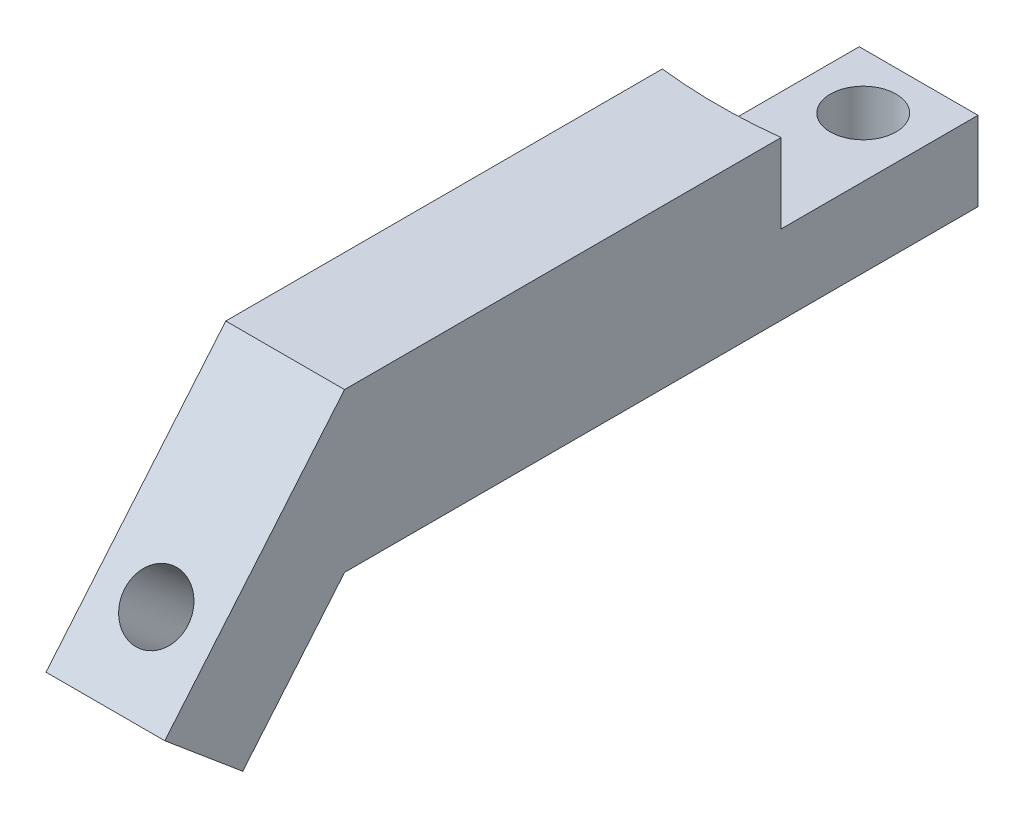
ISO-10303-21;
HEADER;
FILE_DESCRIPTION(('STEP AP214'),'2;1');
FILE_NAME('part.step','',(''),(''),'','','');
FILE_SCHEMA(('AUTOMOTIVE_DESIGN { 1 0 10303 214 1 1 1 1 }'));
ENDSEC;
DATA;
#1=APPLICATION_CONTEXT('core data for automotive mechanical design processes');
#2=APPLICATION_PROTOCOL_DEFINITION('international standard','automotive_design',2000,#1);
#3=PRODUCT_CONTEXT('',#1,'mechanical');
#4=PRODUCT('Part','Part','',(#3));
#5=PRODUCT_RELATED_PRODUCT_CATEGORY('part','',(#4));
#6=PRODUCT_DEFINITION_FORMATION('','',#4);
#7=PRODUCT_DEFINITION_CONTEXT('part definition',#1,'design');
#8=PRODUCT_DEFINITION('design','',#6,#7);
#9=PRODUCT_DEFINITION_SHAPE('','',#8);
#10=(LENGTH_UNIT() NAMED_UNIT(*) SI_UNIT(.MILLI.,.METRE.));
#11=(NAMED_UNIT(*) PLANE_ANGLE_UNIT() SI_UNIT($,.RADIAN.));
#12=(NAMED_UNIT(*) SI_UNIT($,.STERADIAN.) SOLID_ANGLE_UNIT());
#13=UNCERTAINTY_MEASURE_WITH_UNIT(LENGTH_MEASURE(1.E-05),#10,'distance_accuracy_value','');
#14=(GEOMETRIC_REPRESENTATION_CONTEXT(3) GLOBAL_UNCERTAINTY_ASSIGNED_CONTEXT((#13)) GLOBAL_UNIT_ASSIGNED_CONTEXT((#10,
#11,#12)) REPRESENTATION_CONTEXT('',''));
#15=CARTESIAN_POINT('',(0.,0.,0.));
#16=DIRECTION('',(0.,0.,1.));
#17=DIRECTION('',(1.,0.,0.));
#18=AXIS2_PLACEMENT_3D('',#15,#16,#17);
#19=CARTESIAN_POINT('',(0.,10.,0.));
#20=DIRECTION('',(0.,1.,0.));
#21=DIRECTION('',(0.,0.,1.));
#22=AXIS2_PLACEMENT_3D('',#19,#20,#21);
#23=PLANE('',#22);
#24=CARTESIAN_POINT('',(0.,10.,-33.));
#25=DIRECTION('',(0.,1.,0.));
#26=DIRECTION('',(0.,0.,1.));
#27=AXIS2_PLACEMENT_3D('',#24,#25,#26);
#28=CIRCLE('',#27,4.15);
#29=CARTESIAN_POINT('',(0.,10.,-28.85));
#30=VERTEX_POINT('',#29);
#31=EDGE_CURVE('E95',#30,#30,#28,.T.);
#32=ORIENTED_EDGE('',*,*,#31,.F.);
#33=EDGE_LOOP('',(#32));
#34=FACE_BOUND('',#33,.T.);
#35=CARTESIAN_POINT('',(0.,10.,-79.7));
#36=DIRECTION('',(0.,-1.,0.));
#37=DIRECTION('',(0.,0.,-1.));
#38=AXIS2_PLACEMENT_3D('',#35,#36,#37);
#39=CIRCLE('',#38,65.);
#40=CARTESIAN_POINT('',(7.5,10.,-15.1341421492752));
#41=VERTEX_POINT('',#40);
#42=CARTESIAN_POINT('',(-7.5,10.,-15.1341421492752));
#43=VERTEX_POINT('',#42);
#44=EDGE_CURVE('E51',#41,#43,#39,.T.);
#45=ORIENTED_EDGE('',*,*,#44,.F.);
#46=DIRECTION('',(0.,0.,-1.));
#47=VECTOR('',#46,1.);
#48=CARTESIAN_POINT('',(7.50000000000001,10.,40.));
#49=LINE('',#48,#47);
#50=CARTESIAN_POINT('',(7.5,10.,-40.));
#51=VERTEX_POINT('',#50);
#52=EDGE_CURVE('E160',#41,#51,#49,.T.);
#53=ORIENTED_EDGE('',*,*,#52,.T.);
#54=DIRECTION('',(-1.,0.,0.));
#55=VECTOR('',#54,1.);
#56=CARTESIAN_POINT('',(7.5,10.,-40.));
#57=LINE('',#56,#55);
#58=CARTESIAN_POINT('',(-7.5,10.,-40.));
#59=VERTEX_POINT('',#58);
#60=EDGE_CURVE('E57',#51,#59,#57,.T.);
#61=ORIENTED_EDGE('',*,*,#60,.T.);
#62=DIRECTION('',(0.,0.,1.));
#63=VECTOR('',#62,1.);
#64=CARTESIAN_POINT('',(-7.49999999999999,10.,40.));
#65=LINE('',#64,#63);
#66=EDGE_CURVE('E79',#59,#43,#65,.T.);
#67=ORIENTED_EDGE('',*,*,#66,.T.);
#68=EDGE_LOOP('',(#45,#53,#61,#67));
#69=FACE_BOUND('',#68,.T.);
#70=ADVANCED_FACE('F35',(#34,#69),#23,.T.);
#71=CARTESIAN_POINT('',(0.,0.,0.));
#72=DIRECTION('',(0.,1.,0.));
#73=DIRECTION('',(0.,0.,1.));
#74=AXIS2_PLACEMENT_3D('',#71,#72,#73);
#75=PLANE('',#74);
#76=DIRECTION('',(0.,0.,1.));
#77=VECTOR('',#76,1.);
#78=CARTESIAN_POINT('',(-7.49999999999999,0.,40.));
#79=LINE('',#78,#77);
#80=CARTESIAN_POINT('',(-7.5,0.,-40.));
#81=VERTEX_POINT('',#80);
#82=CARTESIAN_POINT('',(-7.49999999999999,0.,40.));
#83=VERTEX_POINT('',#82);
#84=EDGE_CURVE('E86',#81,#83,#79,.T.);
#85=ORIENTED_EDGE('',*,*,#84,.F.);
#86=DIRECTION('',(-1.,0.,0.));
#87=VECTOR('',#86,1.);
#88=CARTESIAN_POINT('',(7.5,0.,-40.));
#89=LINE('',#88,#87);
#90=CARTESIAN_POINT('',(7.5,0.,-40.));
#91=VERTEX_POINT('',#90);
#92=EDGE_CURVE('E72',#91,#81,#89,.T.);
#93=ORIENTED_EDGE('',*,*,#92,.F.);
#94=DIRECTION('',(0.,0.,-1.));
#95=VECTOR('',#94,1.);
#96=CARTESIAN_POINT('',(7.50000000000001,0.,40.));
#97=LINE('',#96,#95);
#98=CARTESIAN_POINT('',(7.50000000000001,0.,40.));
#99=VERTEX_POINT('',#98);
#100=EDGE_CURVE('E80',#99,#91,#97,.T.);
#101=ORIENTED_EDGE('',*,*,#100,.F.);
#102=DIRECTION('',(1.,0.,0.));
#103=VECTOR('',#102,1.);
#104=CARTESIAN_POINT('',(7.50000000000001,0.,40.));
#105=LINE('',#104,#103);
#106=EDGE_CURVE('E93',#83,#99,#105,.T.);
#107=ORIENTED_EDGE('',*,*,#106,.F.);
#108=EDGE_LOOP('',(#85,#93,#101,#107));
#109=FACE_BOUND('',#108,.T.);
#110=CARTESIAN_POINT('',(0.,0.,-33.));
#111=DIRECTION('',(0.,1.,0.));
#112=DIRECTION('',(0.,0.,1.));
#113=AXIS2_PLACEMENT_3D('',#110,#111,#112);
#114=CIRCLE('',#113,4.15);
#115=CARTESIAN_POINT('',(0.,0.,-28.85));
#116=VERTEX_POINT('',#115);
#117=EDGE_CURVE('E99',#116,#116,#114,.T.);
#118=ORIENTED_EDGE('',*,*,#117,.T.);
#119=EDGE_LOOP('',(#118));
#120=FACE_BOUND('',#119,.T.);
#121=ADVANCED_FACE('F90',(#109,#120),#75,.F.);
#122=CARTESIAN_POINT('',(-7.49999999999999,10.,40.));
#123=DIRECTION('',(1.,0.,0.));
#124=DIRECTION('',(0.,0.,-1.));
#125=AXIS2_PLACEMENT_3D('',#122,#123,#124);
#126=PLANE('',#125);
#127=ORIENTED_EDGE('',*,*,#84,.T.);
#128=DIRECTION('',(0.,-0.766044443118975,0.642787609686543));
#129=VECTOR('',#128,1.);
#130=CARTESIAN_POINT('',(-7.49999999999999,0.,40.));
#131=LINE('',#130,#129);
#132=CARTESIAN_POINT('',(-7.49999999999999,-15.3208888623795,52.8557521937309));
#133=VERTEX_POINT('',#132);
#134=EDGE_CURVE('E114',#83,#133,#131,.T.);
#135=ORIENTED_EDGE('',*,*,#134,.T.);
#136=DIRECTION('',(0.,0.642787609686543,0.766044443118975));
#137=VECTOR('',#136,1.);
#138=CARTESIAN_POINT('',(-7.49999999999999,-15.3208888623795,52.8557521937309));
#139=LINE('',#138,#137);
#140=CARTESIAN_POINT('',(-7.49999999999999,-7.05737063904871,62.703829723853));
#141=VERTEX_POINT('',#140);
#142=EDGE_CURVE('E123',#133,#141,#139,.T.);
#143=ORIENTED_EDGE('',*,*,#142,.T.);
#144=DIRECTION('',(0.,0.766044443118975,-0.642787609686543));
#145=VECTOR('',#144,1.);
#146=CARTESIAN_POINT('',(-7.49999999999999,-7.05737063904871,62.703829723853));
#147=LINE('',#146,#145);
#148=CARTESIAN_POINT('',(-7.49999999999999,20.,40.));
#149=VERTEX_POINT('',#148);
#150=EDGE_CURVE('E122',#141,#149,#147,.T.);
#151=ORIENTED_EDGE('',*,*,#150,.T.);
#152=DIRECTION('',(0.,0.,1.));
#153=VECTOR('',#152,1.);
#154=CARTESIAN_POINT('',(-7.49999999999999,20.,40.));
#155=LINE('',#154,#153);
#156=CARTESIAN_POINT('',(-7.5,20.,-15.1341421492752));
#157=VERTEX_POINT('',#156);
#158=EDGE_CURVE('E143',#157,#149,#155,.T.);
#159=ORIENTED_EDGE('',*,*,#158,.F.);
#160=DIRECTION('',(0.,-1.,0.));
#161=VECTOR('',#160,1.);
#162=CARTESIAN_POINT('',(-7.5,20.,-15.1341421492752));
#163=LINE('',#162,#161);
#164=EDGE_CURVE('E156',#157,#43,#163,.T.);
#165=ORIENTED_EDGE('',*,*,#164,.T.);
#166=ORIENTED_EDGE('',*,*,#66,.F.);
#167=DIRECTION('',(0.,-1.,0.));
#168=VECTOR('',#167,1.);
#169=CARTESIAN_POINT('',(-7.5,10.,-40.));
#170=LINE('',#169,#168);
#171=EDGE_CURVE('E44',#59,#81,#170,.T.);
#172=ORIENTED_EDGE('',*,*,#171,.T.);
#173=EDGE_LOOP('',(#127,#135,#143,#151,#159,#165,#166,#172));
#174=FACE_BOUND('',#173,.T.);
#175=ADVANCED_FACE('F37',(#174),#126,.F.);
#176=CARTESIAN_POINT('',(7.50000000000001,10.,40.));
#177=DIRECTION('',(-1.,0.,0.));
#178=DIRECTION('',(0.,0.,1.));
#179=AXIS2_PLACEMENT_3D('',#176,#177,#178);
#180=PLANE('',#179);
#181=ORIENTED_EDGE('',*,*,#100,.T.);
#182=DIRECTION('',(0.,-1.,0.));
#183=VECTOR('',#182,1.);
#184=CARTESIAN_POINT('',(7.5,10.,-40.));
#185=LINE('',#184,#183);
#186=EDGE_CURVE('E11',#51,#91,#185,.T.);
#187=ORIENTED_EDGE('',*,*,#186,.F.);
#188=ORIENTED_EDGE('',*,*,#52,.F.);
#189=DIRECTION('',(0.,-1.,0.));
#190=VECTOR('',#189,1.);
#191=CARTESIAN_POINT('',(7.50000000000001,20.,-15.1341421492752));
#192=LINE('',#191,#190);
#193=CARTESIAN_POINT('',(7.50000000000001,20.,-15.1341421492752));
#194=VERTEX_POINT('',#193);
#195=EDGE_CURVE('E152',#194,#41,#192,.T.);
#196=ORIENTED_EDGE('',*,*,#195,.F.);
#197=DIRECTION('',(0.,0.,-1.));
#198=VECTOR('',#197,1.);
#199=CARTESIAN_POINT('',(7.50000000000001,20.,-15.1341421492752));
#200=LINE('',#199,#198);
#201=CARTESIAN_POINT('',(7.50000000000001,20.,40.));
#202=VERTEX_POINT('',#201);
#203=EDGE_CURVE('E149',#202,#194,#200,.T.);
#204=ORIENTED_EDGE('',*,*,#203,.F.);
#205=DIRECTION('',(0.,-0.766044443118975,0.642787609686543));
#206=VECTOR('',#205,1.);
#207=CARTESIAN_POINT('',(7.50000000000002,-7.05737063904871,62.703829723853));
#208=LINE('',#207,#206);
#209=CARTESIAN_POINT('',(7.50000000000002,-7.05737063904871,62.703829723853));
#210=VERTEX_POINT('',#209);
#211=EDGE_CURVE('E130',#202,#210,#208,.T.);
#212=ORIENTED_EDGE('',*,*,#211,.T.);
#213=DIRECTION('',(0.,-0.642787609686543,-0.766044443118975));
#214=VECTOR('',#213,1.);
#215=CARTESIAN_POINT('',(7.50000000000001,-15.3208888623795,52.8557521937309));
#216=LINE('',#215,#214);
#217=CARTESIAN_POINT('',(7.50000000000001,-15.3208888623795,52.8557521937309));
#218=VERTEX_POINT('',#217);
#219=EDGE_CURVE('E133',#210,#218,#216,.T.);
#220=ORIENTED_EDGE('',*,*,#219,.T.);
#221=DIRECTION('',(0.,0.766044443118975,-0.642787609686543));
#222=VECTOR('',#221,1.);
#223=CARTESIAN_POINT('',(7.50000000000001,0.,40.));
#224=LINE('',#223,#222);
#225=EDGE_CURVE('E109',#218,#99,#224,.T.);
#226=ORIENTED_EDGE('',*,*,#225,.T.);
#227=EDGE_LOOP('',(#181,#187,#188,#196,#204,#212,#220,#226));
#228=FACE_BOUND('',#227,.T.);
#229=ADVANCED_FACE('F106',(#228),#180,.F.);
#230=CARTESIAN_POINT('',(7.5,10.,-40.));
#231=DIRECTION('',(0.,0.,1.));
#232=DIRECTION('',(1.,0.,0.));
#233=AXIS2_PLACEMENT_3D('',#230,#231,#232);
#234=PLANE('',#233);
#235=ORIENTED_EDGE('',*,*,#92,.T.);
#236=ORIENTED_EDGE('',*,*,#171,.F.);
#237=ORIENTED_EDGE('',*,*,#60,.F.);
#238=ORIENTED_EDGE('',*,*,#186,.T.);
#239=EDGE_LOOP('',(#235,#236,#237,#238));
#240=FACE_BOUND('',#239,.T.);
#241=ADVANCED_FACE('F74',(#240),#234,.F.);
#242=CARTESIAN_POINT('',(0.,10.,-33.));
#243=DIRECTION('',(0.,-1.,0.));
#244=DIRECTION('',(0.,0.,-1.));
#245=AXIS2_PLACEMENT_3D('',#242,#243,#244);
#246=CYLINDRICAL_SURFACE('',#245,4.15);
#247=ORIENTED_EDGE('',*,*,#31,.T.);
#248=EDGE_LOOP('',(#247));
#249=FACE_BOUND('',#248,.T.);
#250=ORIENTED_EDGE('',*,*,#117,.F.);
#251=EDGE_LOOP('',(#250));
#252=FACE_BOUND('',#251,.T.);
#253=ADVANCED_FACE('F212',(#249,#252),#246,.F.);
#254=CARTESIAN_POINT('',(0.,20.,-79.7));
#255=DIRECTION('',(0.,-1.,0.));
#256=DIRECTION('',(0.,0.,-1.));
#257=AXIS2_PLACEMENT_3D('',#254,#255,#256);
#258=CYLINDRICAL_SURFACE('',#257,65.);
#259=ORIENTED_EDGE('',*,*,#44,.T.);
#260=ORIENTED_EDGE('',*,*,#164,.F.);
#261=CARTESIAN_POINT('',(0.,20.,-79.7));
#262=DIRECTION('',(0.,-1.,0.));
#263=DIRECTION('',(0.,0.,-1.));
#264=AXIS2_PLACEMENT_3D('',#261,#262,#263);
#265=CIRCLE('',#264,65.);
#266=EDGE_CURVE('E140',#194,#157,#265,.T.);
#267=ORIENTED_EDGE('',*,*,#266,.F.);
#268=ORIENTED_EDGE('',*,*,#195,.T.);
#269=EDGE_LOOP('',(#259,#260,#267,#268));
#270=FACE_BOUND('',#269,.T.);
#271=ADVANCED_FACE('F165',(#270),#258,.F.);
#272=CARTESIAN_POINT('',(0.,20.,-79.7));
#273=DIRECTION('',(0.,-1.,0.));
#274=DIRECTION('',(0.,0.,-1.));
#275=AXIS2_PLACEMENT_3D('',#272,#273,#274);
#276=PLANE('',#275);
#277=ORIENTED_EDGE('',*,*,#266,.T.);
#278=ORIENTED_EDGE('',*,*,#158,.T.);
#279=DIRECTION('',(1.,0.,0.));
#280=VECTOR('',#279,1.);
#281=CARTESIAN_POINT('',(7.50000000000001,20.,40.));
#282=LINE('',#281,#280);
#283=EDGE_CURVE('E146',#149,#202,#282,.T.);
#284=ORIENTED_EDGE('',*,*,#283,.T.);
#285=ORIENTED_EDGE('',*,*,#203,.T.);
#286=EDGE_LOOP('',(#277,#278,#284,#285));
#287=FACE_BOUND('',#286,.T.);
#288=ADVANCED_FACE('F172',(#287),#276,.F.);
#289=CARTESIAN_POINT('',(-49.488439768087,0.,40.));
#290=DIRECTION('',(0.,-0.642787609686543,-0.766044443118975));
#291=DIRECTION('',(0.,0.766044443118975,-0.642787609686543));
#292=AXIS2_PLACEMENT_3D('',#289,#290,#291);
#293=PLANE('',#292);
#294=CARTESIAN_POINT('',(0.,-7.66044443118975,46.4278760968655));
#295=DIRECTION('',(0.,-0.642787609686543,-0.766044443118975));
#296=DIRECTION('',(0.,0.766044443118975,-0.642787609686543));
#297=AXIS2_PLACEMENT_3D('',#294,#295,#296);
#298=CIRCLE('',#297,4.);
#299=CARTESIAN_POINT('',(0.,-4.59626665871385,43.8567256581193));
#300=VERTEX_POINT('',#299);
#301=EDGE_CURVE('E307',#300,#300,#298,.T.);
#302=ORIENTED_EDGE('',*,*,#301,.F.);
#303=EDGE_LOOP('',(#302));
#304=FACE_BOUND('',#303,.T.);
#305=ORIENTED_EDGE('',*,*,#134,.F.);
#306=ORIENTED_EDGE('',*,*,#106,.T.);
#307=ORIENTED_EDGE('',*,*,#225,.F.);
#308=DIRECTION('',(1.,0.,0.));
#309=VECTOR('',#308,1.);
#310=CARTESIAN_POINT('',(-49.488439768087,-15.3208888623795,52.8557521937309));
#311=LINE('',#310,#309);
#312=EDGE_CURVE('E117',#133,#218,#311,.T.);
#313=ORIENTED_EDGE('',*,*,#312,.F.);
#314=EDGE_LOOP('',(#305,#306,#307,#313));
#315=FACE_BOUND('',#314,.T.);
#316=ADVANCED_FACE('F111',(#304,#315),#293,.T.);
#317=CARTESIAN_POINT('',(-49.488439768087,-15.3208888623795,52.8557521937309));
#318=DIRECTION('',(0.,-0.766044443118975,0.642787609686543));
#319=DIRECTION('',(0.,-0.642787609686543,-0.766044443118975));
#320=AXIS2_PLACEMENT_3D('',#317,#318,#319);
#321=PLANE('',#320);
#322=ORIENTED_EDGE('',*,*,#142,.F.);
#323=ORIENTED_EDGE('',*,*,#312,.T.);
#324=ORIENTED_EDGE('',*,*,#219,.F.);
#325=DIRECTION('',(1.,0.,0.));
#326=VECTOR('',#325,1.);
#327=CARTESIAN_POINT('',(-49.488439768087,-7.05737063904871,62.703829723853));
#328=LINE('',#327,#326);
#329=EDGE_CURVE('E136',#141,#210,#328,.T.);
#330=ORIENTED_EDGE('',*,*,#329,.F.);
#331=EDGE_LOOP('',(#322,#323,#324,#330));
#332=FACE_BOUND('',#331,.T.);
#333=ADVANCED_FACE('F189',(#332),#321,.T.);
#334=CARTESIAN_POINT('',(-49.488439768087,-7.05737063904871,62.703829723853));
#335=DIRECTION('',(0.,0.642787609686543,0.766044443118975));
#336=DIRECTION('',(0.,-0.766044443118975,0.642787609686543));
#337=AXIS2_PLACEMENT_3D('',#334,#335,#336);
#338=PLANE('',#337);
#339=CARTESIAN_POINT('',(0.,0.603073792141036,56.2759536269875));
#340=DIRECTION('',(0.,0.642787609686543,0.766044443118975));
#341=DIRECTION('',(0.,-0.766044443118975,0.642787609686543));
#342=AXIS2_PLACEMENT_3D('',#339,#340,#341);
#343=CIRCLE('',#342,4.);
#344=CARTESIAN_POINT('',(0.,-2.46110398033487,58.8471040657337));
#345=VERTEX_POINT('',#344);
#346=EDGE_CURVE('E39',#345,#345,#343,.T.);
#347=ORIENTED_EDGE('',*,*,#346,.F.);
#348=EDGE_LOOP('',(#347));
#349=FACE_BOUND('',#348,.T.);
#350=ORIENTED_EDGE('',*,*,#150,.F.);
#351=ORIENTED_EDGE('',*,*,#329,.T.);
#352=ORIENTED_EDGE('',*,*,#211,.F.);
#353=ORIENTED_EDGE('',*,*,#283,.F.);
#354=EDGE_LOOP('',(#350,#351,#352,#353));
#355=FACE_BOUND('',#354,.T.);
#356=ADVANCED_FACE('F184',(#349,#355),#338,.T.);
#357=CARTESIAN_POINT('',(0.,11.7825275597008,69.5991078177176));
#358=DIRECTION('',(0.,-0.642787609686543,-0.766044443118975));
#359=DIRECTION('',(0.,0.766044443118975,-0.642787609686543));
#360=AXIS2_PLACEMENT_3D('',#357,#358,#359);
#361=CYLINDRICAL_SURFACE('',#360,4.);
#362=ORIENTED_EDGE('',*,*,#346,.T.);
#363=EDGE_LOOP('',(#362));
#364=FACE_BOUND('',#363,.T.);
#365=ORIENTED_EDGE('',*,*,#301,.T.);
#366=EDGE_LOOP('',(#365));
#367=FACE_BOUND('',#366,.T.);
#368=ADVANCED_FACE('F198',(#364,#367),#361,.F.);
#369=CLOSED_SHELL('',(#70,#121,#175,#229,#241,#253,#271,#288,#316,#333,#356,#368));
#370=MANIFOLD_SOLID_BREP('B2',#369);
#371=ADVANCED_BREP_SHAPE_REPRESENTATION('',(#18,#370),#14);
#372=SHAPE_DEFINITION_REPRESENTATION(#9,#371);
ENDSEC;
END-ISO-10303-21;
